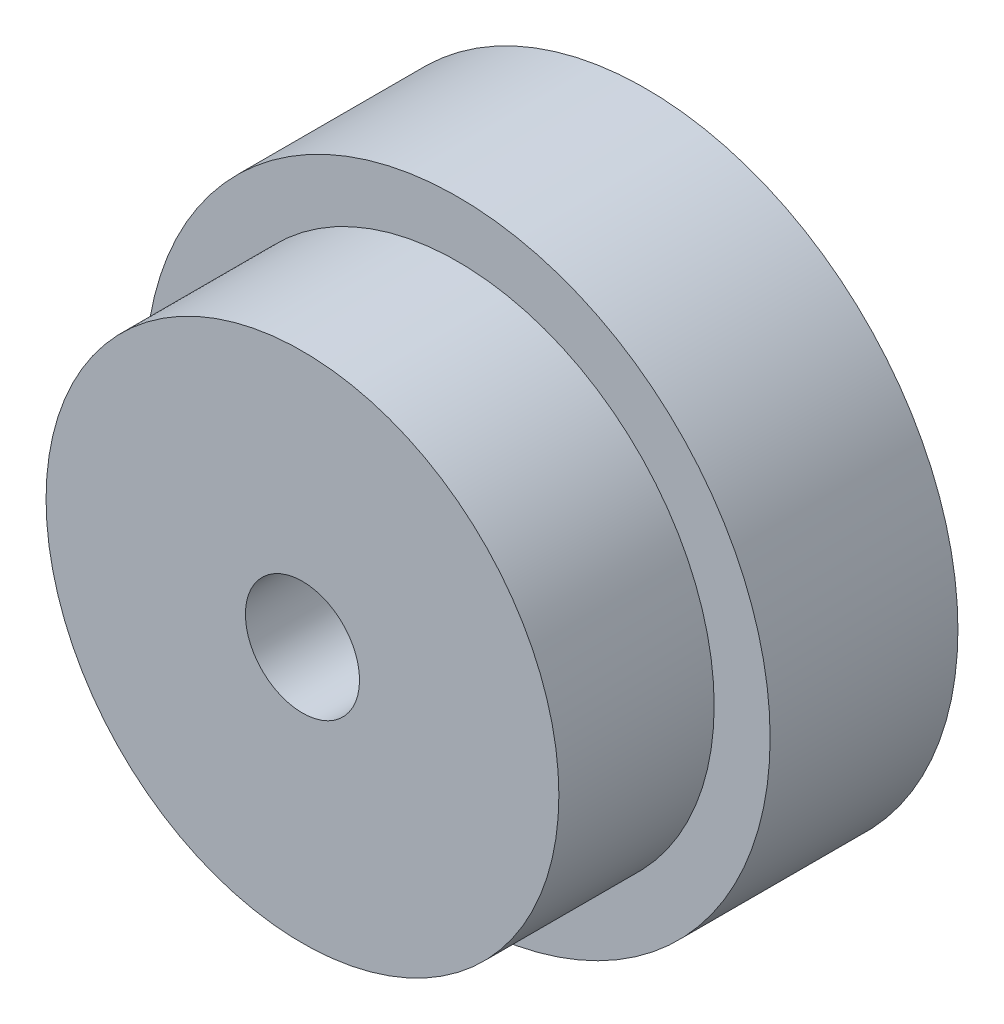
ISO-10303-21;
HEADER;
FILE_DESCRIPTION(('STEP AP214'),'2;1');
FILE_NAME('part.step','',(''),(''),'','','');
FILE_SCHEMA(('AUTOMOTIVE_DESIGN { 1 0 10303 214 1 1 1 1 }'));
ENDSEC;
DATA;
#1=APPLICATION_CONTEXT('core data for automotive mechanical design processes');
#2=APPLICATION_PROTOCOL_DEFINITION('international standard','automotive_design',2000,#1);
#3=PRODUCT_CONTEXT('',#1,'mechanical');
#4=PRODUCT('Part','Part','',(#3));
#5=PRODUCT_RELATED_PRODUCT_CATEGORY('part','',(#4));
#6=PRODUCT_DEFINITION_FORMATION('','',#4);
#7=PRODUCT_DEFINITION_CONTEXT('part definition',#1,'design');
#8=PRODUCT_DEFINITION('design','',#6,#7);
#9=PRODUCT_DEFINITION_SHAPE('','',#8);
#10=(LENGTH_UNIT() NAMED_UNIT(*) SI_UNIT(.MILLI.,.METRE.));
#11=(NAMED_UNIT(*) PLANE_ANGLE_UNIT() SI_UNIT($,.RADIAN.));
#12=(NAMED_UNIT(*) SI_UNIT($,.STERADIAN.) SOLID_ANGLE_UNIT());
#13=UNCERTAINTY_MEASURE_WITH_UNIT(LENGTH_MEASURE(1.E-05),#10,'distance_accuracy_value','');
#14=(GEOMETRIC_REPRESENTATION_CONTEXT(3) GLOBAL_UNCERTAINTY_ASSIGNED_CONTEXT((#13)) GLOBAL_UNIT_ASSIGNED_CONTEXT((#10,
#11,#12)) REPRESENTATION_CONTEXT('',''));
#15=CARTESIAN_POINT('',(0.,0.,0.));
#16=DIRECTION('',(0.,0.,1.));
#17=DIRECTION('',(1.,0.,0.));
#18=AXIS2_PLACEMENT_3D('',#15,#16,#17);
#19=CARTESIAN_POINT('',(0.,0.,6.604));
#20=DIRECTION('',(0.,0.,1.));
#21=DIRECTION('',(1.,0.,0.));
#22=AXIS2_PLACEMENT_3D('',#19,#20,#21);
#23=PLANE('',#22);
#24=CARTESIAN_POINT('',(0.,0.,6.604));
#25=DIRECTION('',(0.,0.,1.));
#26=DIRECTION('',(1.,0.,0.));
#27=AXIS2_PLACEMENT_3D('',#24,#25,#26);
#28=CIRCLE('',#27,10.9855);
#29=CARTESIAN_POINT('',(10.9855,0.,6.604));
#30=VERTEX_POINT('',#29);
#31=EDGE_CURVE('E10',#30,#30,#28,.T.);
#32=ORIENTED_EDGE('',*,*,#31,.T.);
#33=EDGE_LOOP('',(#32));
#34=FACE_BOUND('',#33,.T.);
#35=CARTESIAN_POINT('',(0.,0.,6.604));
#36=DIRECTION('',(0.,0.,1.));
#37=DIRECTION('',(1.,0.,0.));
#38=AXIS2_PLACEMENT_3D('',#35,#36,#37);
#39=CIRCLE('',#38,9.017);
#40=CARTESIAN_POINT('',(9.017,0.,6.604));
#41=VERTEX_POINT('',#40);
#42=EDGE_CURVE('E44',#41,#41,#39,.T.);
#43=ORIENTED_EDGE('',*,*,#42,.F.);
#44=EDGE_LOOP('',(#43));
#45=FACE_BOUND('',#44,.T.);
#46=ADVANCED_FACE('F31',(#34,#45),#23,.T.);
#47=CARTESIAN_POINT('',(0.,0.,6.604));
#48=DIRECTION('',(0.,0.,-1.));
#49=DIRECTION('',(-1.,0.,0.));
#50=AXIS2_PLACEMENT_3D('',#47,#48,#49);
#51=CYLINDRICAL_SURFACE('',#50,10.9855);
#52=ORIENTED_EDGE('',*,*,#31,.F.);
#53=EDGE_LOOP('',(#52));
#54=FACE_BOUND('',#53,.T.);
#55=CARTESIAN_POINT('',(0.,0.,0.));
#56=DIRECTION('',(0.,0.,1.));
#57=DIRECTION('',(1.,0.,0.));
#58=AXIS2_PLACEMENT_3D('',#55,#56,#57);
#59=CIRCLE('',#58,10.9855);
#60=CARTESIAN_POINT('',(10.9855,0.,0.));
#61=VERTEX_POINT('',#60);
#62=EDGE_CURVE('E35',#61,#61,#59,.T.);
#63=ORIENTED_EDGE('',*,*,#62,.T.);
#64=EDGE_LOOP('',(#63));
#65=FACE_BOUND('',#64,.T.);
#66=ADVANCED_FACE('F33',(#54,#65),#51,.T.);
#67=CARTESIAN_POINT('',(0.,0.,0.));
#68=DIRECTION('',(0.,0.,1.));
#69=DIRECTION('',(1.,0.,0.));
#70=AXIS2_PLACEMENT_3D('',#67,#68,#69);
#71=PLANE('',#70);
#72=CARTESIAN_POINT('',(0.,0.,0.));
#73=DIRECTION('',(0.,0.,1.));
#74=DIRECTION('',(1.,0.,0.));
#75=AXIS2_PLACEMENT_3D('',#72,#73,#74);
#76=CIRCLE('',#75,2.0066);
#77=CARTESIAN_POINT('',(2.0066,0.,0.));
#78=VERTEX_POINT('',#77);
#79=EDGE_CURVE('E47',#78,#78,#76,.T.);
#80=ORIENTED_EDGE('',*,*,#79,.T.);
#81=EDGE_LOOP('',(#80));
#82=FACE_BOUND('',#81,.T.);
#83=ORIENTED_EDGE('',*,*,#62,.F.);
#84=EDGE_LOOP('',(#83));
#85=FACE_BOUND('',#84,.T.);
#86=ADVANCED_FACE('F56',(#82,#85),#71,.F.);
#87=CARTESIAN_POINT('',(0.,0.,12.065));
#88=DIRECTION('',(0.,0.,-1.));
#89=DIRECTION('',(-1.,0.,0.));
#90=AXIS2_PLACEMENT_3D('',#87,#88,#89);
#91=CYLINDRICAL_SURFACE('',#90,9.017);
#92=CARTESIAN_POINT('',(0.,0.,12.065));
#93=DIRECTION('',(0.,0.,1.));
#94=DIRECTION('',(1.,0.,0.));
#95=AXIS2_PLACEMENT_3D('',#92,#93,#94);
#96=CIRCLE('',#95,9.017);
#97=CARTESIAN_POINT('',(9.017,0.,12.065));
#98=VERTEX_POINT('',#97);
#99=EDGE_CURVE('E42',#98,#98,#96,.T.);
#100=ORIENTED_EDGE('',*,*,#99,.F.);
#101=EDGE_LOOP('',(#100));
#102=FACE_BOUND('',#101,.T.);
#103=ORIENTED_EDGE('',*,*,#42,.T.);
#104=EDGE_LOOP('',(#103));
#105=FACE_BOUND('',#104,.T.);
#106=ADVANCED_FACE('F68',(#102,#105),#91,.T.);
#107=CARTESIAN_POINT('',(0.,0.,12.065));
#108=DIRECTION('',(0.,0.,1.));
#109=DIRECTION('',(1.,0.,0.));
#110=AXIS2_PLACEMENT_3D('',#107,#108,#109);
#111=PLANE('',#110);
#112=CARTESIAN_POINT('',(0.,0.,12.065));
#113=DIRECTION('',(0.,0.,1.));
#114=DIRECTION('',(1.,0.,0.));
#115=AXIS2_PLACEMENT_3D('',#112,#113,#114);
#116=CIRCLE('',#115,2.0066);
#117=CARTESIAN_POINT('',(2.0066,0.,12.065));
#118=VERTEX_POINT('',#117);
#119=EDGE_CURVE('E50',#118,#118,#116,.T.);
#120=ORIENTED_EDGE('',*,*,#119,.F.);
#121=EDGE_LOOP('',(#120));
#122=FACE_BOUND('',#121,.T.);
#123=ORIENTED_EDGE('',*,*,#99,.T.);
#124=EDGE_LOOP('',(#123));
#125=FACE_BOUND('',#124,.T.);
#126=ADVANCED_FACE('F62',(#122,#125),#111,.T.);
#127=CARTESIAN_POINT('',(0.,0.,0.));
#128=DIRECTION('',(0.,0.,1.));
#129=DIRECTION('',(1.,0.,0.));
#130=AXIS2_PLACEMENT_3D('',#127,#128,#129);
#131=CYLINDRICAL_SURFACE('',#130,2.0066);
#132=ORIENTED_EDGE('',*,*,#79,.F.);
#133=EDGE_LOOP('',(#132));
#134=FACE_BOUND('',#133,.T.);
#135=ORIENTED_EDGE('',*,*,#119,.T.);
#136=EDGE_LOOP('',(#135));
#137=FACE_BOUND('',#136,.T.);
#138=ADVANCED_FACE('F59',(#134,#137),#131,.F.);
#139=CLOSED_SHELL('',(#46,#66,#86,#106,#126,#138));
#140=MANIFOLD_SOLID_BREP('B2',#139);
#141=ADVANCED_BREP_SHAPE_REPRESENTATION('',(#18,#140),#14);
#142=SHAPE_DEFINITION_REPRESENTATION(#9,#141);
ENDSEC;
END-ISO-10303-21;
